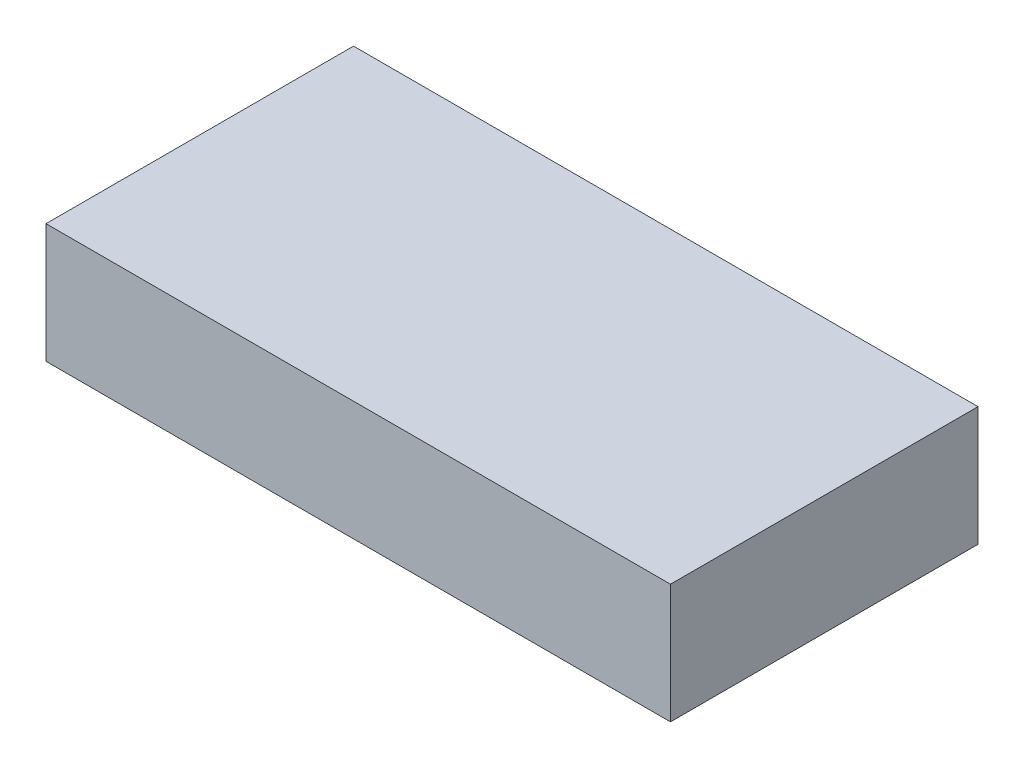
ISO-10303-21;
HEADER;
FILE_DESCRIPTION(('STEP AP214'),'2;1');
FILE_NAME('part.step','',(''),(''),'','','');
FILE_SCHEMA(('AUTOMOTIVE_DESIGN { 1 0 10303 214 1 1 1 1 }'));
ENDSEC;
DATA;
#1=APPLICATION_CONTEXT('core data for automotive mechanical design processes');
#2=APPLICATION_PROTOCOL_DEFINITION('international standard','automotive_design',2000,#1);
#3=PRODUCT_CONTEXT('',#1,'mechanical');
#4=PRODUCT('Part','Part','',(#3));
#5=PRODUCT_RELATED_PRODUCT_CATEGORY('part','',(#4));
#6=PRODUCT_DEFINITION_FORMATION('','',#4);
#7=PRODUCT_DEFINITION_CONTEXT('part definition',#1,'design');
#8=PRODUCT_DEFINITION('design','',#6,#7);
#9=PRODUCT_DEFINITION_SHAPE('','',#8);
#10=(LENGTH_UNIT() NAMED_UNIT(*) SI_UNIT(.MILLI.,.METRE.));
#11=(NAMED_UNIT(*) PLANE_ANGLE_UNIT() SI_UNIT($,.RADIAN.));
#12=(NAMED_UNIT(*) SI_UNIT($,.STERADIAN.) SOLID_ANGLE_UNIT());
#13=UNCERTAINTY_MEASURE_WITH_UNIT(LENGTH_MEASURE(1.E-05),#10,'distance_accuracy_value','');
#14=(GEOMETRIC_REPRESENTATION_CONTEXT(3) GLOBAL_UNCERTAINTY_ASSIGNED_CONTEXT((#13)) GLOBAL_UNIT_ASSIGNED_CONTEXT((#10,
#11,#12)) REPRESENTATION_CONTEXT('',''));
#15=CARTESIAN_POINT('',(0.,0.,0.));
#16=DIRECTION('',(0.,0.,1.));
#17=DIRECTION('',(1.,0.,0.));
#18=AXIS2_PLACEMENT_3D('',#15,#16,#17);
#19=CARTESIAN_POINT('',(99.5,19.,49.));
#20=DIRECTION('',(-1.,0.,0.));
#21=DIRECTION('',(0.,0.,1.));
#22=AXIS2_PLACEMENT_3D('',#19,#20,#21);
#23=PLANE('',#22);
#24=DIRECTION('',(0.,0.,-1.));
#25=VECTOR('',#24,1.);
#26=CARTESIAN_POINT('',(99.5,-19.,49.));
#27=LINE('',#26,#25);
#28=CARTESIAN_POINT('',(99.5,-19.,49.));
#29=VERTEX_POINT('',#28);
#30=CARTESIAN_POINT('',(99.5,-19.,-49.));
#31=VERTEX_POINT('',#30);
#32=EDGE_CURVE('E95',#29,#31,#27,.T.);
#33=ORIENTED_EDGE('',*,*,#32,.T.);
#34=DIRECTION('',(0.,-1.,0.));
#35=VECTOR('',#34,1.);
#36=CARTESIAN_POINT('',(99.5,19.,-49.));
#37=LINE('',#36,#35);
#38=CARTESIAN_POINT('',(99.5,19.,-49.));
#39=VERTEX_POINT('',#38);
#40=EDGE_CURVE('E11',#39,#31,#37,.T.);
#41=ORIENTED_EDGE('',*,*,#40,.F.);
#42=DIRECTION('',(0.,0.,-1.));
#43=VECTOR('',#42,1.);
#44=CARTESIAN_POINT('',(99.5,19.,49.));
#45=LINE('',#44,#43);
#46=CARTESIAN_POINT('',(99.5,19.,49.));
#47=VERTEX_POINT('',#46);
#48=EDGE_CURVE('E83',#47,#39,#45,.T.);
#49=ORIENTED_EDGE('',*,*,#48,.F.);
#50=DIRECTION('',(0.,-1.,0.));
#51=VECTOR('',#50,1.);
#52=CARTESIAN_POINT('',(99.5,19.,49.));
#53=LINE('',#52,#51);
#54=EDGE_CURVE('E91',#47,#29,#53,.T.);
#55=ORIENTED_EDGE('',*,*,#54,.T.);
#56=EDGE_LOOP('',(#33,#41,#49,#55));
#57=FACE_BOUND('',#56,.T.);
#58=ADVANCED_FACE('F32',(#57),#23,.F.);
#59=CARTESIAN_POINT('',(-99.5,19.,-49.));
#60=DIRECTION('',(0.,0.,1.));
#61=DIRECTION('',(1.,0.,0.));
#62=AXIS2_PLACEMENT_3D('',#59,#60,#61);
#63=PLANE('',#62);
#64=DIRECTION('',(-1.,0.,0.));
#65=VECTOR('',#64,1.);
#66=CARTESIAN_POINT('',(-99.5,-19.,-49.));
#67=LINE('',#66,#65);
#68=CARTESIAN_POINT('',(-99.5,-19.,-49.));
#69=VERTEX_POINT('',#68);
#70=EDGE_CURVE('E87',#31,#69,#67,.T.);
#71=ORIENTED_EDGE('',*,*,#70,.T.);
#72=DIRECTION('',(0.,-1.,0.));
#73=VECTOR('',#72,1.);
#74=CARTESIAN_POINT('',(-99.5,19.,-49.));
#75=LINE('',#74,#73);
#76=CARTESIAN_POINT('',(-99.5,19.,-49.));
#77=VERTEX_POINT('',#76);
#78=EDGE_CURVE('E40',#77,#69,#75,.T.);
#79=ORIENTED_EDGE('',*,*,#78,.F.);
#80=DIRECTION('',(-1.,0.,0.));
#81=VECTOR('',#80,1.);
#82=CARTESIAN_POINT('',(-99.5,19.,-49.));
#83=LINE('',#82,#81);
#84=EDGE_CURVE('E78',#39,#77,#83,.T.);
#85=ORIENTED_EDGE('',*,*,#84,.F.);
#86=ORIENTED_EDGE('',*,*,#40,.T.);
#87=EDGE_LOOP('',(#71,#79,#85,#86));
#88=FACE_BOUND('',#87,.T.);
#89=ADVANCED_FACE('F86',(#88),#63,.F.);
#90=CARTESIAN_POINT('',(-99.5,19.,49.));
#91=DIRECTION('',(1.,0.,0.));
#92=DIRECTION('',(0.,0.,-1.));
#93=AXIS2_PLACEMENT_3D('',#90,#91,#92);
#94=PLANE('',#93);
#95=DIRECTION('',(0.,0.,1.));
#96=VECTOR('',#95,1.);
#97=CARTESIAN_POINT('',(-99.5,-19.,49.));
#98=LINE('',#97,#96);
#99=CARTESIAN_POINT('',(-99.5,-19.,49.));
#100=VERTEX_POINT('',#99);
#101=EDGE_CURVE('E65',#69,#100,#98,.T.);
#102=ORIENTED_EDGE('',*,*,#101,.T.);
#103=DIRECTION('',(0.,-1.,0.));
#104=VECTOR('',#103,1.);
#105=CARTESIAN_POINT('',(-99.5,19.,49.));
#106=LINE('',#105,#104);
#107=CARTESIAN_POINT('',(-99.5,19.,49.));
#108=VERTEX_POINT('',#107);
#109=EDGE_CURVE('E88',#108,#100,#106,.T.);
#110=ORIENTED_EDGE('',*,*,#109,.F.);
#111=DIRECTION('',(0.,0.,1.));
#112=VECTOR('',#111,1.);
#113=CARTESIAN_POINT('',(-99.5,19.,49.));
#114=LINE('',#113,#112);
#115=EDGE_CURVE('E81',#77,#108,#114,.T.);
#116=ORIENTED_EDGE('',*,*,#115,.F.);
#117=ORIENTED_EDGE('',*,*,#78,.T.);
#118=EDGE_LOOP('',(#102,#110,#116,#117));
#119=FACE_BOUND('',#118,.T.);
#120=ADVANCED_FACE('F89',(#119),#94,.F.);
#121=CARTESIAN_POINT('',(-99.5,19.,49.));
#122=DIRECTION('',(0.,0.,-1.));
#123=DIRECTION('',(-1.,0.,0.));
#124=AXIS2_PLACEMENT_3D('',#121,#122,#123);
#125=PLANE('',#124);
#126=DIRECTION('',(1.,0.,0.));
#127=VECTOR('',#126,1.);
#128=CARTESIAN_POINT('',(-99.5,-19.,49.));
#129=LINE('',#128,#127);
#130=EDGE_CURVE('E71',#100,#29,#129,.T.);
#131=ORIENTED_EDGE('',*,*,#130,.T.);
#132=ORIENTED_EDGE('',*,*,#54,.F.);
#133=DIRECTION('',(1.,0.,0.));
#134=VECTOR('',#133,1.);
#135=CARTESIAN_POINT('',(-99.5,19.,49.));
#136=LINE('',#135,#134);
#137=EDGE_CURVE('E48',#108,#47,#136,.T.);
#138=ORIENTED_EDGE('',*,*,#137,.F.);
#139=ORIENTED_EDGE('',*,*,#109,.T.);
#140=EDGE_LOOP('',(#131,#132,#138,#139));
#141=FACE_BOUND('',#140,.T.);
#142=ADVANCED_FACE('F102',(#141),#125,.F.);
#143=CARTESIAN_POINT('',(0.,19.,0.));
#144=DIRECTION('',(0.,-1.,0.));
#145=DIRECTION('',(0.,0.,-1.));
#146=AXIS2_PLACEMENT_3D('',#143,#144,#145);
#147=PLANE('',#146);
#148=ORIENTED_EDGE('',*,*,#48,.T.);
#149=ORIENTED_EDGE('',*,*,#84,.T.);
#150=ORIENTED_EDGE('',*,*,#115,.T.);
#151=ORIENTED_EDGE('',*,*,#137,.T.);
#152=EDGE_LOOP('',(#148,#149,#150,#151));
#153=FACE_BOUND('',#152,.T.);
#154=ADVANCED_FACE('F79',(#153),#147,.F.);
#155=CARTESIAN_POINT('',(0.,-19.,0.));
#156=DIRECTION('',(0.,-1.,0.));
#157=DIRECTION('',(0.,0.,-1.));
#158=AXIS2_PLACEMENT_3D('',#155,#156,#157);
#159=PLANE('',#158);
#160=ORIENTED_EDGE('',*,*,#32,.F.);
#161=ORIENTED_EDGE('',*,*,#130,.F.);
#162=ORIENTED_EDGE('',*,*,#101,.F.);
#163=ORIENTED_EDGE('',*,*,#70,.F.);
#164=EDGE_LOOP('',(#160,#161,#162,#163));
#165=FACE_BOUND('',#164,.T.);
#166=ADVANCED_FACE('F105',(#165),#159,.T.);
#167=CLOSED_SHELL('',(#58,#89,#120,#142,#154,#166));
#168=MANIFOLD_SOLID_BREP('B2',#167);
#169=ADVANCED_BREP_SHAPE_REPRESENTATION('',(#18,#168),#14);
#170=SHAPE_DEFINITION_REPRESENTATION(#9,#169);
ENDSEC;
END-ISO-10303-21;
